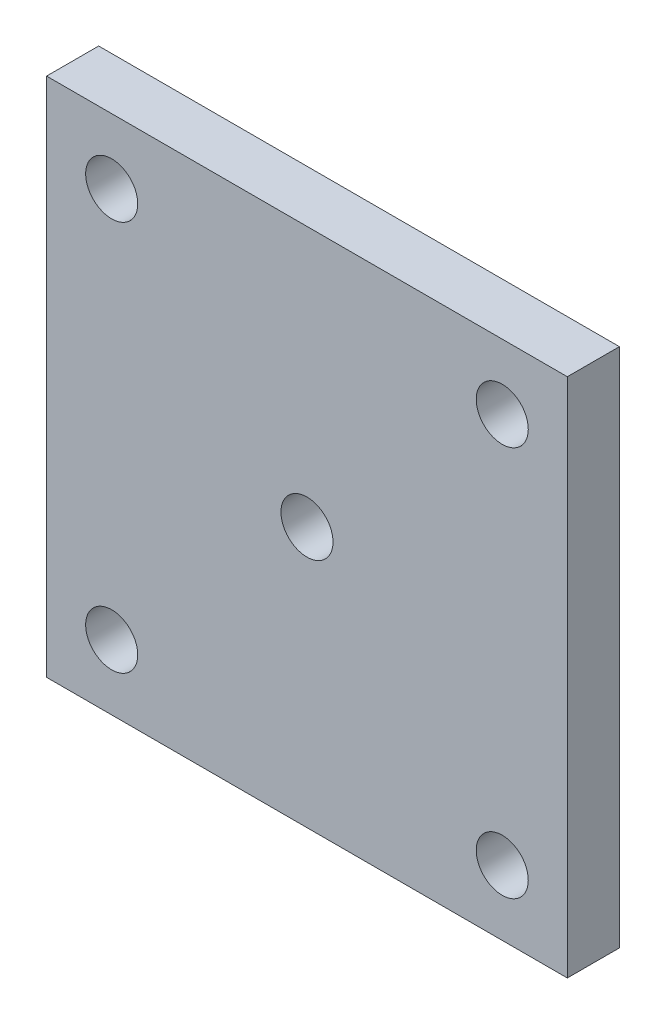
ISO-10303-21;
HEADER;
FILE_DESCRIPTION(('STEP AP214'),'2;1');
FILE_NAME('part.step','',(''),(''),'','','');
FILE_SCHEMA(('AUTOMOTIVE_DESIGN { 1 0 10303 214 1 1 1 1 }'));
ENDSEC;
DATA;
#1=APPLICATION_CONTEXT('core data for automotive mechanical design processes');
#2=APPLICATION_PROTOCOL_DEFINITION('international standard','automotive_design',2000,#1);
#3=PRODUCT_CONTEXT('',#1,'mechanical');
#4=PRODUCT('Part','Part','',(#3));
#5=PRODUCT_RELATED_PRODUCT_CATEGORY('part','',(#4));
#6=PRODUCT_DEFINITION_FORMATION('','',#4);
#7=PRODUCT_DEFINITION_CONTEXT('part definition',#1,'design');
#8=PRODUCT_DEFINITION('design','',#6,#7);
#9=PRODUCT_DEFINITION_SHAPE('','',#8);
#10=(LENGTH_UNIT() NAMED_UNIT(*) SI_UNIT(.MILLI.,.METRE.));
#11=(NAMED_UNIT(*) PLANE_ANGLE_UNIT() SI_UNIT($,.RADIAN.));
#12=(NAMED_UNIT(*) SI_UNIT($,.STERADIAN.) SOLID_ANGLE_UNIT());
#13=UNCERTAINTY_MEASURE_WITH_UNIT(LENGTH_MEASURE(1.E-05),#10,'distance_accuracy_value','');
#14=(GEOMETRIC_REPRESENTATION_CONTEXT(3) GLOBAL_UNCERTAINTY_ASSIGNED_CONTEXT((#13)) GLOBAL_UNIT_ASSIGNED_CONTEXT((#10,
#11,#12)) REPRESENTATION_CONTEXT('',''));
#15=CARTESIAN_POINT('',(0.,0.,0.));
#16=DIRECTION('',(0.,0.,1.));
#17=DIRECTION('',(1.,0.,0.));
#18=AXIS2_PLACEMENT_3D('',#15,#16,#17);
#19=CARTESIAN_POINT('',(-20.,-20.,4.));
#20=DIRECTION('',(1.,0.,0.));
#21=DIRECTION('',(0.,0.,-1.));
#22=AXIS2_PLACEMENT_3D('',#19,#20,#21);
#23=PLANE('',#22);
#24=DIRECTION('',(0.,-1.,0.));
#25=VECTOR('',#24,1.);
#26=CARTESIAN_POINT('',(-20.,-20.,0.));
#27=LINE('',#26,#25);
#28=CARTESIAN_POINT('',(-20.,20.,0.));
#29=VERTEX_POINT('',#28);
#30=CARTESIAN_POINT('',(-20.,-20.,0.));
#31=VERTEX_POINT('',#30);
#32=EDGE_CURVE('E100',#29,#31,#27,.T.);
#33=ORIENTED_EDGE('',*,*,#32,.T.);
#34=DIRECTION('',(0.,0.,-1.));
#35=VECTOR('',#34,1.);
#36=CARTESIAN_POINT('',(-20.,-20.,4.));
#37=LINE('',#36,#35);
#38=CARTESIAN_POINT('',(-20.,-20.,4.));
#39=VERTEX_POINT('',#38);
#40=EDGE_CURVE('E11',#39,#31,#37,.T.);
#41=ORIENTED_EDGE('',*,*,#40,.F.);
#42=DIRECTION('',(0.,-1.,0.));
#43=VECTOR('',#42,1.);
#44=CARTESIAN_POINT('',(-20.,-20.,4.));
#45=LINE('',#44,#43);
#46=CARTESIAN_POINT('',(-20.,20.,4.));
#47=VERTEX_POINT('',#46);
#48=EDGE_CURVE('E88',#47,#39,#45,.T.);
#49=ORIENTED_EDGE('',*,*,#48,.F.);
#50=DIRECTION('',(0.,0.,-1.));
#51=VECTOR('',#50,1.);
#52=CARTESIAN_POINT('',(-20.,20.,4.));
#53=LINE('',#52,#51);
#54=EDGE_CURVE('E96',#47,#29,#53,.T.);
#55=ORIENTED_EDGE('',*,*,#54,.T.);
#56=EDGE_LOOP('',(#33,#41,#49,#55));
#57=FACE_BOUND('',#56,.T.);
#58=ADVANCED_FACE('F37',(#57),#23,.F.);
#59=CARTESIAN_POINT('',(20.,-20.,4.));
#60=DIRECTION('',(0.,1.,0.));
#61=DIRECTION('',(-1.,0.,0.));
#62=AXIS2_PLACEMENT_3D('',#59,#60,#61);
#63=PLANE('',#62);
#64=DIRECTION('',(1.,0.,0.));
#65=VECTOR('',#64,1.);
#66=CARTESIAN_POINT('',(20.,-20.,0.));
#67=LINE('',#66,#65);
#68=CARTESIAN_POINT('',(20.,-20.,0.));
#69=VERTEX_POINT('',#68);
#70=EDGE_CURVE('E92',#31,#69,#67,.T.);
#71=ORIENTED_EDGE('',*,*,#70,.T.);
#72=DIRECTION('',(0.,0.,-1.));
#73=VECTOR('',#72,1.);
#74=CARTESIAN_POINT('',(20.,-20.,4.));
#75=LINE('',#74,#73);
#76=CARTESIAN_POINT('',(20.,-20.,4.));
#77=VERTEX_POINT('',#76);
#78=EDGE_CURVE('E45',#77,#69,#75,.T.);
#79=ORIENTED_EDGE('',*,*,#78,.F.);
#80=DIRECTION('',(1.,0.,0.));
#81=VECTOR('',#80,1.);
#82=CARTESIAN_POINT('',(20.,-20.,4.));
#83=LINE('',#82,#81);
#84=EDGE_CURVE('E83',#39,#77,#83,.T.);
#85=ORIENTED_EDGE('',*,*,#84,.F.);
#86=ORIENTED_EDGE('',*,*,#40,.T.);
#87=EDGE_LOOP('',(#71,#79,#85,#86));
#88=FACE_BOUND('',#87,.T.);
#89=ADVANCED_FACE('F91',(#88),#63,.F.);
#90=CARTESIAN_POINT('',(20.,-20.,4.));
#91=DIRECTION('',(-1.,0.,0.));
#92=DIRECTION('',(0.,0.,1.));
#93=AXIS2_PLACEMENT_3D('',#90,#91,#92);
#94=PLANE('',#93);
#95=DIRECTION('',(0.,1.,0.));
#96=VECTOR('',#95,1.);
#97=CARTESIAN_POINT('',(20.,-20.,0.));
#98=LINE('',#97,#96);
#99=CARTESIAN_POINT('',(20.,20.,0.));
#100=VERTEX_POINT('',#99);
#101=EDGE_CURVE('E70',#69,#100,#98,.T.);
#102=ORIENTED_EDGE('',*,*,#101,.T.);
#103=DIRECTION('',(0.,0.,-1.));
#104=VECTOR('',#103,1.);
#105=CARTESIAN_POINT('',(20.,20.,4.));
#106=LINE('',#105,#104);
#107=CARTESIAN_POINT('',(20.,20.,4.));
#108=VERTEX_POINT('',#107);
#109=EDGE_CURVE('E93',#108,#100,#106,.T.);
#110=ORIENTED_EDGE('',*,*,#109,.F.);
#111=DIRECTION('',(0.,1.,0.));
#112=VECTOR('',#111,1.);
#113=CARTESIAN_POINT('',(20.,-20.,4.));
#114=LINE('',#113,#112);
#115=EDGE_CURVE('E86',#77,#108,#114,.T.);
#116=ORIENTED_EDGE('',*,*,#115,.F.);
#117=ORIENTED_EDGE('',*,*,#78,.T.);
#118=EDGE_LOOP('',(#102,#110,#116,#117));
#119=FACE_BOUND('',#118,.T.);
#120=ADVANCED_FACE('F94',(#119),#94,.F.);
#121=CARTESIAN_POINT('',(20.,20.,4.));
#122=DIRECTION('',(0.,-1.,0.));
#123=DIRECTION('',(1.,0.,0.));
#124=AXIS2_PLACEMENT_3D('',#121,#122,#123);
#125=PLANE('',#124);
#126=DIRECTION('',(-1.,0.,0.));
#127=VECTOR('',#126,1.);
#128=CARTESIAN_POINT('',(20.,20.,0.));
#129=LINE('',#128,#127);
#130=EDGE_CURVE('E76',#100,#29,#129,.T.);
#131=ORIENTED_EDGE('',*,*,#130,.T.);
#132=ORIENTED_EDGE('',*,*,#54,.F.);
#133=DIRECTION('',(-1.,0.,0.));
#134=VECTOR('',#133,1.);
#135=CARTESIAN_POINT('',(20.,20.,4.));
#136=LINE('',#135,#134);
#137=EDGE_CURVE('E53',#108,#47,#136,.T.);
#138=ORIENTED_EDGE('',*,*,#137,.F.);
#139=ORIENTED_EDGE('',*,*,#109,.T.);
#140=EDGE_LOOP('',(#131,#132,#138,#139));
#141=FACE_BOUND('',#140,.T.);
#142=ADVANCED_FACE('F108',(#141),#125,.F.);
#143=CARTESIAN_POINT('',(0.,0.,4.));
#144=DIRECTION('',(0.,0.,1.));
#145=DIRECTION('',(1.,0.,0.));
#146=AXIS2_PLACEMENT_3D('',#143,#144,#145);
#147=PLANE('',#146);
#148=CARTESIAN_POINT('',(0.,0.,4.));
#149=DIRECTION('',(0.,0.,1.));
#150=DIRECTION('',(1.,0.,0.));
#151=AXIS2_PLACEMENT_3D('',#148,#149,#150);
#152=CIRCLE('',#151,2.);
#153=CARTESIAN_POINT('',(2.,0.,4.));
#154=VERTEX_POINT('',#153);
#155=EDGE_CURVE('E138',#154,#154,#152,.T.);
#156=ORIENTED_EDGE('',*,*,#155,.F.);
#157=EDGE_LOOP('',(#156));
#158=FACE_BOUND('',#157,.T.);
#159=CARTESIAN_POINT('',(-14.9999999999992,-15.,4.));
#160=DIRECTION('',(0.,0.,1.));
#161=DIRECTION('',(1.,0.,0.));
#162=AXIS2_PLACEMENT_3D('',#159,#160,#161);
#163=CIRCLE('',#162,2.00000000000045);
#164=CARTESIAN_POINT('',(-12.9999999999987,-15.,4.));
#165=VERTEX_POINT('',#164);
#166=EDGE_CURVE('E120',#165,#165,#163,.T.);
#167=ORIENTED_EDGE('',*,*,#166,.F.);
#168=EDGE_LOOP('',(#167));
#169=FACE_BOUND('',#168,.T.);
#170=CARTESIAN_POINT('',(15.0000000000008,-14.9999999999992,4.));
#171=DIRECTION('',(0.,0.,1.));
#172=DIRECTION('',(1.,0.,0.));
#173=AXIS2_PLACEMENT_3D('',#170,#171,#172);
#174=CIRCLE('',#173,2.00000000000118);
#175=CARTESIAN_POINT('',(17.000000000002,-14.9999999999992,4.));
#176=VERTEX_POINT('',#175);
#177=EDGE_CURVE('E127',#176,#176,#174,.T.);
#178=ORIENTED_EDGE('',*,*,#177,.F.);
#179=EDGE_LOOP('',(#178));
#180=FACE_BOUND('',#179,.T.);
#181=CARTESIAN_POINT('',(15.,15.0000000000008,4.));
#182=DIRECTION('',(0.,0.,1.));
#183=DIRECTION('',(1.,0.,0.));
#184=AXIS2_PLACEMENT_3D('',#181,#182,#183);
#185=CIRCLE('',#184,2.00000000000087);
#186=CARTESIAN_POINT('',(17.0000000000009,15.0000000000008,4.));
#187=VERTEX_POINT('',#186);
#188=EDGE_CURVE('E133',#187,#187,#185,.T.);
#189=ORIENTED_EDGE('',*,*,#188,.F.);
#190=EDGE_LOOP('',(#189));
#191=FACE_BOUND('',#190,.T.);
#192=CARTESIAN_POINT('',(-15.,15.,4.));
#193=DIRECTION('',(0.,0.,1.));
#194=DIRECTION('',(1.,0.,0.));
#195=AXIS2_PLACEMENT_3D('',#192,#193,#194);
#196=CIRCLE('',#195,2.);
#197=CARTESIAN_POINT('',(-13.,15.,4.));
#198=VERTEX_POINT('',#197);
#199=EDGE_CURVE('E114',#198,#198,#196,.T.);
#200=ORIENTED_EDGE('',*,*,#199,.F.);
#201=EDGE_LOOP('',(#200));
#202=FACE_BOUND('',#201,.T.);
#203=ORIENTED_EDGE('',*,*,#48,.T.);
#204=ORIENTED_EDGE('',*,*,#84,.T.);
#205=ORIENTED_EDGE('',*,*,#115,.T.);
#206=ORIENTED_EDGE('',*,*,#137,.T.);
#207=EDGE_LOOP('',(#203,#204,#205,#206));
#208=FACE_BOUND('',#207,.T.);
#209=ADVANCED_FACE('F84',(#158,#169,#180,#191,#202,#208),#147,.T.);
#210=CARTESIAN_POINT('',(0.,0.,0.));
#211=DIRECTION('',(0.,0.,1.));
#212=DIRECTION('',(1.,0.,0.));
#213=AXIS2_PLACEMENT_3D('',#210,#211,#212);
#214=PLANE('',#213);
#215=CARTESIAN_POINT('',(0.,0.,0.));
#216=DIRECTION('',(0.,0.,1.));
#217=DIRECTION('',(1.,0.,0.));
#218=AXIS2_PLACEMENT_3D('',#215,#216,#217);
#219=CIRCLE('',#218,2.);
#220=CARTESIAN_POINT('',(2.,0.,0.));
#221=VERTEX_POINT('',#220);
#222=EDGE_CURVE('E124',#221,#221,#219,.T.);
#223=ORIENTED_EDGE('',*,*,#222,.T.);
#224=EDGE_LOOP('',(#223));
#225=FACE_BOUND('',#224,.T.);
#226=CARTESIAN_POINT('',(-14.9999999999992,-15.,0.));
#227=DIRECTION('',(0.,0.,1.));
#228=DIRECTION('',(1.,0.,0.));
#229=AXIS2_PLACEMENT_3D('',#226,#227,#228);
#230=CIRCLE('',#229,2.00000000000045);
#231=CARTESIAN_POINT('',(-12.9999999999987,-15.,0.));
#232=VERTEX_POINT('',#231);
#233=EDGE_CURVE('E123',#232,#232,#230,.T.);
#234=ORIENTED_EDGE('',*,*,#233,.T.);
#235=EDGE_LOOP('',(#234));
#236=FACE_BOUND('',#235,.T.);
#237=CARTESIAN_POINT('',(15.0000000000008,-14.9999999999992,0.));
#238=DIRECTION('',(0.,0.,1.));
#239=DIRECTION('',(1.,0.,0.));
#240=AXIS2_PLACEMENT_3D('',#237,#238,#239);
#241=CIRCLE('',#240,2.00000000000118);
#242=CARTESIAN_POINT('',(17.000000000002,-14.9999999999992,0.));
#243=VERTEX_POINT('',#242);
#244=EDGE_CURVE('E130',#243,#243,#241,.T.);
#245=ORIENTED_EDGE('',*,*,#244,.T.);
#246=EDGE_LOOP('',(#245));
#247=FACE_BOUND('',#246,.T.);
#248=CARTESIAN_POINT('',(15.,15.0000000000008,0.));
#249=DIRECTION('',(0.,0.,1.));
#250=DIRECTION('',(1.,0.,0.));
#251=AXIS2_PLACEMENT_3D('',#248,#249,#250);
#252=CIRCLE('',#251,2.00000000000087);
#253=CARTESIAN_POINT('',(17.0000000000009,15.0000000000008,0.));
#254=VERTEX_POINT('',#253);
#255=EDGE_CURVE('E117',#254,#254,#252,.T.);
#256=ORIENTED_EDGE('',*,*,#255,.T.);
#257=EDGE_LOOP('',(#256));
#258=FACE_BOUND('',#257,.T.);
#259=CARTESIAN_POINT('',(-15.,15.,0.));
#260=DIRECTION('',(0.,0.,1.));
#261=DIRECTION('',(1.,0.,0.));
#262=AXIS2_PLACEMENT_3D('',#259,#260,#261);
#263=CIRCLE('',#262,2.);
#264=CARTESIAN_POINT('',(-13.,15.,0.));
#265=VERTEX_POINT('',#264);
#266=EDGE_CURVE('E103',#265,#265,#263,.T.);
#267=ORIENTED_EDGE('',*,*,#266,.T.);
#268=EDGE_LOOP('',(#267));
#269=FACE_BOUND('',#268,.T.);
#270=ORIENTED_EDGE('',*,*,#32,.F.);
#271=ORIENTED_EDGE('',*,*,#130,.F.);
#272=ORIENTED_EDGE('',*,*,#101,.F.);
#273=ORIENTED_EDGE('',*,*,#70,.F.);
#274=EDGE_LOOP('',(#270,#271,#272,#273));
#275=FACE_BOUND('',#274,.T.);
#276=ADVANCED_FACE('F111',(#225,#236,#247,#258,#269,#275),#214,.F.);
#277=CARTESIAN_POINT('',(-15.,15.,0.));
#278=DIRECTION('',(0.,0.,1.));
#279=DIRECTION('',(1.,0.,0.));
#280=AXIS2_PLACEMENT_3D('',#277,#278,#279);
#281=CYLINDRICAL_SURFACE('',#280,2.);
#282=ORIENTED_EDGE('',*,*,#266,.F.);
#283=EDGE_LOOP('',(#282));
#284=FACE_BOUND('',#283,.T.);
#285=ORIENTED_EDGE('',*,*,#199,.T.);
#286=EDGE_LOOP('',(#285));
#287=FACE_BOUND('',#286,.T.);
#288=ADVANCED_FACE('F164',(#284,#287),#281,.F.);
#289=CARTESIAN_POINT('',(15.,15.0000000000008,0.));
#290=DIRECTION('',(0.,0.,1.));
#291=DIRECTION('',(1.,0.,0.));
#292=AXIS2_PLACEMENT_3D('',#289,#290,#291);
#293=CYLINDRICAL_SURFACE('',#292,2.00000000000087);
#294=ORIENTED_EDGE('',*,*,#255,.F.);
#295=EDGE_LOOP('',(#294));
#296=FACE_BOUND('',#295,.T.);
#297=ORIENTED_EDGE('',*,*,#188,.T.);
#298=EDGE_LOOP('',(#297));
#299=FACE_BOUND('',#298,.T.);
#300=ADVANCED_FACE('F166',(#296,#299),#293,.F.);
#301=CARTESIAN_POINT('',(15.0000000000008,-14.9999999999992,0.));
#302=DIRECTION('',(0.,0.,1.));
#303=DIRECTION('',(1.,0.,0.));
#304=AXIS2_PLACEMENT_3D('',#301,#302,#303);
#305=CYLINDRICAL_SURFACE('',#304,2.00000000000118);
#306=ORIENTED_EDGE('',*,*,#244,.F.);
#307=EDGE_LOOP('',(#306));
#308=FACE_BOUND('',#307,.T.);
#309=ORIENTED_EDGE('',*,*,#177,.T.);
#310=EDGE_LOOP('',(#309));
#311=FACE_BOUND('',#310,.T.);
#312=ADVANCED_FACE('F173',(#308,#311),#305,.F.);
#313=CARTESIAN_POINT('',(-14.9999999999992,-15.,0.));
#314=DIRECTION('',(0.,0.,1.));
#315=DIRECTION('',(1.,0.,0.));
#316=AXIS2_PLACEMENT_3D('',#313,#314,#315);
#317=CYLINDRICAL_SURFACE('',#316,2.00000000000045);
#318=ORIENTED_EDGE('',*,*,#233,.F.);
#319=EDGE_LOOP('',(#318));
#320=FACE_BOUND('',#319,.T.);
#321=ORIENTED_EDGE('',*,*,#166,.T.);
#322=EDGE_LOOP('',(#321));
#323=FACE_BOUND('',#322,.T.);
#324=ADVANCED_FACE('F149',(#320,#323),#317,.F.);
#325=CARTESIAN_POINT('',(0.,0.,0.));
#326=DIRECTION('',(0.,0.,1.));
#327=DIRECTION('',(1.,0.,0.));
#328=AXIS2_PLACEMENT_3D('',#325,#326,#327);
#329=CYLINDRICAL_SURFACE('',#328,2.);
#330=ORIENTED_EDGE('',*,*,#222,.F.);
#331=EDGE_LOOP('',(#330));
#332=FACE_BOUND('',#331,.T.);
#333=ORIENTED_EDGE('',*,*,#155,.T.);
#334=EDGE_LOOP('',(#333));
#335=FACE_BOUND('',#334,.T.);
#336=ADVANCED_FACE('F146',(#332,#335),#329,.F.);
#337=CLOSED_SHELL('',(#58,#89,#120,#142,#209,#276,#288,#300,#312,#324,#336));
#338=MANIFOLD_SOLID_BREP('B2',#337);
#339=ADVANCED_BREP_SHAPE_REPRESENTATION('',(#18,#338),#14);
#340=SHAPE_DEFINITION_REPRESENTATION(#9,#339);
ENDSEC;
END-ISO-10303-21;
